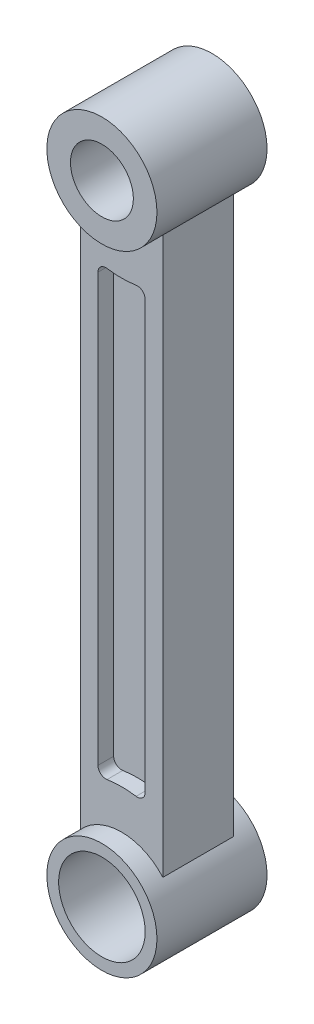
ISO-10303-21;
HEADER;
FILE_DESCRIPTION(('STEP AP214'),'2;1');
FILE_NAME('part.step','',(''),(''),'','','');
FILE_SCHEMA(('AUTOMOTIVE_DESIGN { 1 0 10303 214 1 1 1 1 }'));
ENDSEC;
DATA;
#1=APPLICATION_CONTEXT('core data for automotive mechanical design processes');
#2=APPLICATION_PROTOCOL_DEFINITION('international standard','automotive_design',2000,#1);
#3=PRODUCT_CONTEXT('',#1,'mechanical');
#4=PRODUCT('Part','Part','',(#3));
#5=PRODUCT_RELATED_PRODUCT_CATEGORY('part','',(#4));
#6=PRODUCT_DEFINITION_FORMATION('','',#4);
#7=PRODUCT_DEFINITION_CONTEXT('part definition',#1,'design');
#8=PRODUCT_DEFINITION('design','',#6,#7);
#9=PRODUCT_DEFINITION_SHAPE('','',#8);
#10=(LENGTH_UNIT() NAMED_UNIT(*) SI_UNIT(.MILLI.,.METRE.));
#11=(NAMED_UNIT(*) PLANE_ANGLE_UNIT() SI_UNIT($,.RADIAN.));
#12=(NAMED_UNIT(*) SI_UNIT($,.STERADIAN.) SOLID_ANGLE_UNIT());
#13=UNCERTAINTY_MEASURE_WITH_UNIT(LENGTH_MEASURE(1.E-05),#10,'distance_accuracy_value','');
#14=(GEOMETRIC_REPRESENTATION_CONTEXT(3) GLOBAL_UNCERTAINTY_ASSIGNED_CONTEXT((#13)) GLOBAL_UNIT_ASSIGNED_CONTEXT((#10,
#11,#12)) REPRESENTATION_CONTEXT('',''));
#15=CARTESIAN_POINT('',(0.,0.,0.));
#16=DIRECTION('',(0.,0.,1.));
#17=DIRECTION('',(1.,0.,0.));
#18=AXIS2_PLACEMENT_3D('',#15,#16,#17);
#19=CARTESIAN_POINT('',(0.,80.,-4.5));
#20=DIRECTION('',(0.,0.,1.));
#21=DIRECTION('',(1.,0.,0.));
#22=AXIS2_PLACEMENT_3D('',#19,#20,#21);
#23=PLANE('',#22);
#24=CARTESIAN_POINT('',(0.,80.,-4.5));
#25=DIRECTION('',(0.,0.,-1.));
#26=DIRECTION('',(1.,0.,0.));
#27=AXIS2_PLACEMENT_3D('',#24,#25,#26);
#28=CIRCLE('',#27,7.00000000000001);
#29=CARTESIAN_POINT('',(5.25,75.369935205637,-4.5));
#30=VERTEX_POINT('',#29);
#31=CARTESIAN_POINT('',(-5.25,75.369935205637,-4.5));
#32=VERTEX_POINT('',#31);
#33=EDGE_CURVE('E366',#30,#32,#28,.T.);
#34=ORIENTED_EDGE('',*,*,#33,.F.);
#35=DIRECTION('',(0.,1.,0.));
#36=VECTOR('',#35,1.);
#37=CARTESIAN_POINT('',(5.25,75.369935205637,-4.5));
#38=LINE('',#37,#36);
#39=CARTESIAN_POINT('',(5.25000000000001,4.63006479436302,-4.5));
#40=VERTEX_POINT('',#39);
#41=EDGE_CURVE('E375',#40,#30,#38,.T.);
#42=ORIENTED_EDGE('',*,*,#41,.F.);
#43=CARTESIAN_POINT('',(0.,0.,-4.5));
#44=DIRECTION('',(0.,0.,-1.));
#45=DIRECTION('',(-1.,0.,0.));
#46=AXIS2_PLACEMENT_3D('',#43,#44,#45);
#47=CIRCLE('',#46,7.);
#48=CARTESIAN_POINT('',(-5.24999999999999,4.63006479436304,-4.5));
#49=VERTEX_POINT('',#48);
#50=EDGE_CURVE('E394',#49,#40,#47,.T.);
#51=ORIENTED_EDGE('',*,*,#50,.F.);
#52=DIRECTION('',(0.,-1.,0.));
#53=VECTOR('',#52,1.);
#54=CARTESIAN_POINT('',(-5.25,75.369935205637,-4.5));
#55=LINE('',#54,#53);
#56=EDGE_CURVE('E390',#32,#49,#55,.T.);
#57=ORIENTED_EDGE('',*,*,#56,.F.);
#58=EDGE_LOOP('',(#34,#42,#51,#57));
#59=FACE_BOUND('',#58,.T.);
#60=CARTESIAN_POINT('',(0.,80.,-4.5));
#61=DIRECTION('',(0.,0.,1.));
#62=DIRECTION('',(1.,0.,0.));
#63=AXIS2_PLACEMENT_3D('',#60,#61,#62);
#64=CIRCLE('',#63,12.);
#65=CARTESIAN_POINT('',(-1.84615384615385,68.1428622350783,-4.5));
#66=VERTEX_POINT('',#65);
#67=CARTESIAN_POINT('',(1.84615384615385,68.1428622350783,-4.5));
#68=VERTEX_POINT('',#67);
#69=EDGE_CURVE('E228',#66,#68,#64,.T.);
#70=ORIENTED_EDGE('',*,*,#69,.F.);
#71=CARTESIAN_POINT('',(-2.,67.1547674213349,-4.5));
#72=DIRECTION('',(0.,0.,1.));
#73=DIRECTION('',(1.,0.,0.));
#74=AXIS2_PLACEMENT_3D('',#71,#72,#73);
#75=CIRCLE('',#74,1.);
#76=CARTESIAN_POINT('',(-3.,67.1547674213349,-4.5));
#77=VERTEX_POINT('',#76);
#78=EDGE_CURVE('E55',#77,#66,#75,.F.);
#79=ORIENTED_EDGE('',*,*,#78,.F.);
#80=DIRECTION('',(0.,-1.,0.));
#81=VECTOR('',#80,1.);
#82=CARTESIAN_POINT('',(-2.99999999999999,0.,-4.5));
#83=LINE('',#82,#81);
#84=CARTESIAN_POINT('',(-2.99999999999999,12.8452325786651,-4.5));
#85=VERTEX_POINT('',#84);
#86=EDGE_CURVE('E201',#77,#85,#83,.T.);
#87=ORIENTED_EDGE('',*,*,#86,.T.);
#88=CARTESIAN_POINT('',(-1.99999999999999,12.8452325786651,-4.5));
#89=DIRECTION('',(0.,0.,1.));
#90=DIRECTION('',(1.,0.,0.));
#91=AXIS2_PLACEMENT_3D('',#88,#89,#90);
#92=CIRCLE('',#91,1.);
#93=CARTESIAN_POINT('',(-1.84615384615384,11.8571377649217,-4.5));
#94=VERTEX_POINT('',#93);
#95=EDGE_CURVE('E205',#85,#94,#92,.T.);
#96=ORIENTED_EDGE('',*,*,#95,.T.);
#97=CARTESIAN_POINT('',(0.,0.,-4.5));
#98=DIRECTION('',(0.,0.,1.));
#99=DIRECTION('',(1.,0.,0.));
#100=AXIS2_PLACEMENT_3D('',#97,#98,#99);
#101=CIRCLE('',#100,12.);
#102=CARTESIAN_POINT('',(1.84615384615386,11.8571377649217,-4.5));
#103=VERTEX_POINT('',#102);
#104=EDGE_CURVE('E243',#94,#103,#101,.F.);
#105=ORIENTED_EDGE('',*,*,#104,.T.);
#106=CARTESIAN_POINT('',(2.00000000000002,12.8452325786651,-4.5));
#107=DIRECTION('',(0.,0.,1.));
#108=DIRECTION('',(1.,0.,0.));
#109=AXIS2_PLACEMENT_3D('',#106,#107,#108);
#110=CIRCLE('',#109,1.);
#111=CARTESIAN_POINT('',(3.00000000000002,12.8452325786651,-4.5));
#112=VERTEX_POINT('',#111);
#113=EDGE_CURVE('E239',#112,#103,#110,.F.);
#114=ORIENTED_EDGE('',*,*,#113,.F.);
#115=DIRECTION('',(0.,-1.,0.));
#116=VECTOR('',#115,1.);
#117=CARTESIAN_POINT('',(3.00000000000002,0.,-4.5));
#118=LINE('',#117,#116);
#119=CARTESIAN_POINT('',(3.00000000000001,67.1547674213349,-4.5));
#120=VERTEX_POINT('',#119);
#121=EDGE_CURVE('E235',#120,#112,#118,.T.);
#122=ORIENTED_EDGE('',*,*,#121,.F.);
#123=CARTESIAN_POINT('',(2.00000000000001,67.1547674213349,-4.5));
#124=DIRECTION('',(0.,0.,1.));
#125=DIRECTION('',(1.,0.,0.));
#126=AXIS2_PLACEMENT_3D('',#123,#124,#125);
#127=CIRCLE('',#126,1.);
#128=EDGE_CURVE('E231',#120,#68,#127,.T.);
#129=ORIENTED_EDGE('',*,*,#128,.T.);
#130=EDGE_LOOP('',(#70,#79,#87,#96,#105,#114,#122,#129));
#131=FACE_BOUND('',#130,.T.);
#132=ADVANCED_FACE('F39',(#59,#131),#23,.F.);
#133=CARTESIAN_POINT('',(0.,80.,4.5));
#134=DIRECTION('',(0.,0.,1.));
#135=DIRECTION('',(1.,0.,0.));
#136=AXIS2_PLACEMENT_3D('',#133,#134,#135);
#137=PLANE('',#136);
#138=CARTESIAN_POINT('',(0.,80.,4.5));
#139=DIRECTION('',(0.,0.,-1.));
#140=DIRECTION('',(1.,0.,0.));
#141=AXIS2_PLACEMENT_3D('',#138,#139,#140);
#142=CIRCLE('',#141,7.00000000000001);
#143=CARTESIAN_POINT('',(5.25,75.369935205637,4.5));
#144=VERTEX_POINT('',#143);
#145=CARTESIAN_POINT('',(-5.25,75.369935205637,4.5));
#146=VERTEX_POINT('',#145);
#147=EDGE_CURVE('E370',#144,#146,#142,.T.);
#148=ORIENTED_EDGE('',*,*,#147,.T.);
#149=DIRECTION('',(0.,-1.,0.));
#150=VECTOR('',#149,1.);
#151=CARTESIAN_POINT('',(-5.25,75.369935205637,4.5));
#152=LINE('',#151,#150);
#153=CARTESIAN_POINT('',(-5.24999999999999,4.63006479436304,4.5));
#154=VERTEX_POINT('',#153);
#155=EDGE_CURVE('E374',#146,#154,#152,.T.);
#156=ORIENTED_EDGE('',*,*,#155,.T.);
#157=CARTESIAN_POINT('',(0.,0.,4.5));
#158=DIRECTION('',(0.,0.,-1.));
#159=DIRECTION('',(-1.,0.,0.));
#160=AXIS2_PLACEMENT_3D('',#157,#158,#159);
#161=CIRCLE('',#160,7.);
#162=CARTESIAN_POINT('',(5.25000000000001,4.63006479436302,4.5));
#163=VERTEX_POINT('',#162);
#164=EDGE_CURVE('E379',#154,#163,#161,.T.);
#165=ORIENTED_EDGE('',*,*,#164,.T.);
#166=DIRECTION('',(0.,1.,0.));
#167=VECTOR('',#166,1.);
#168=CARTESIAN_POINT('',(5.25,75.369935205637,4.5));
#169=LINE('',#168,#167);
#170=EDGE_CURVE('E383',#163,#144,#169,.T.);
#171=ORIENTED_EDGE('',*,*,#170,.T.);
#172=EDGE_LOOP('',(#148,#156,#165,#171));
#173=FACE_BOUND('',#172,.T.);
#174=DIRECTION('',(0.,-1.,0.));
#175=VECTOR('',#174,1.);
#176=CARTESIAN_POINT('',(-2.99999999999999,0.,4.5));
#177=LINE('',#176,#175);
#178=CARTESIAN_POINT('',(-3.,67.1547674213349,4.5));
#179=VERTEX_POINT('',#178);
#180=CARTESIAN_POINT('',(-2.99999999999999,12.8452325786651,4.5));
#181=VERTEX_POINT('',#180);
#182=EDGE_CURVE('E303',#179,#181,#177,.T.);
#183=ORIENTED_EDGE('',*,*,#182,.F.);
#184=CARTESIAN_POINT('',(-2.,67.1547674213349,4.5));
#185=DIRECTION('',(0.,0.,1.));
#186=DIRECTION('',(1.,0.,0.));
#187=AXIS2_PLACEMENT_3D('',#184,#185,#186);
#188=CIRCLE('',#187,1.);
#189=CARTESIAN_POINT('',(-1.84615384615385,68.1428622350783,4.5));
#190=VERTEX_POINT('',#189);
#191=EDGE_CURVE('E63',#179,#190,#188,.F.);
#192=ORIENTED_EDGE('',*,*,#191,.T.);
#193=CARTESIAN_POINT('',(0.,80.,4.5));
#194=DIRECTION('',(0.,0.,1.));
#195=DIRECTION('',(1.,0.,0.));
#196=AXIS2_PLACEMENT_3D('',#193,#194,#195);
#197=CIRCLE('',#196,12.);
#198=CARTESIAN_POINT('',(1.84615384615385,68.1428622350783,4.5));
#199=VERTEX_POINT('',#198);
#200=EDGE_CURVE('E275',#190,#199,#197,.T.);
#201=ORIENTED_EDGE('',*,*,#200,.T.);
#202=CARTESIAN_POINT('',(2.00000000000001,67.1547674213349,4.5));
#203=DIRECTION('',(0.,0.,1.));
#204=DIRECTION('',(1.,0.,0.));
#205=AXIS2_PLACEMENT_3D('',#202,#203,#204);
#206=CIRCLE('',#205,1.);
#207=CARTESIAN_POINT('',(3.00000000000001,67.1547674213349,4.5));
#208=VERTEX_POINT('',#207);
#209=EDGE_CURVE('E323',#208,#199,#206,.T.);
#210=ORIENTED_EDGE('',*,*,#209,.F.);
#211=DIRECTION('',(0.,-1.,0.));
#212=VECTOR('',#211,1.);
#213=CARTESIAN_POINT('',(3.00000000000002,0.,4.5));
#214=LINE('',#213,#212);
#215=CARTESIAN_POINT('',(3.00000000000002,12.8452325786651,4.5));
#216=VERTEX_POINT('',#215);
#217=EDGE_CURVE('E319',#208,#216,#214,.T.);
#218=ORIENTED_EDGE('',*,*,#217,.T.);
#219=CARTESIAN_POINT('',(2.00000000000002,12.8452325786651,4.5));
#220=DIRECTION('',(0.,0.,1.));
#221=DIRECTION('',(1.,0.,0.));
#222=AXIS2_PLACEMENT_3D('',#219,#220,#221);
#223=CIRCLE('',#222,1.);
#224=CARTESIAN_POINT('',(1.84615384615386,11.8571377649217,4.5));
#225=VERTEX_POINT('',#224);
#226=EDGE_CURVE('E315',#216,#225,#223,.F.);
#227=ORIENTED_EDGE('',*,*,#226,.T.);
#228=CARTESIAN_POINT('',(0.,0.,4.5));
#229=DIRECTION('',(0.,0.,1.));
#230=DIRECTION('',(1.,0.,0.));
#231=AXIS2_PLACEMENT_3D('',#228,#229,#230);
#232=CIRCLE('',#231,12.);
#233=CARTESIAN_POINT('',(-1.84615384615384,11.8571377649217,4.5));
#234=VERTEX_POINT('',#233);
#235=EDGE_CURVE('E311',#234,#225,#232,.F.);
#236=ORIENTED_EDGE('',*,*,#235,.F.);
#237=CARTESIAN_POINT('',(-1.99999999999999,12.8452325786651,4.5));
#238=DIRECTION('',(0.,0.,1.));
#239=DIRECTION('',(1.,0.,0.));
#240=AXIS2_PLACEMENT_3D('',#237,#238,#239);
#241=CIRCLE('',#240,1.);
#242=EDGE_CURVE('E307',#181,#234,#241,.T.);
#243=ORIENTED_EDGE('',*,*,#242,.F.);
#244=EDGE_LOOP('',(#183,#192,#201,#210,#218,#227,#236,#243));
#245=FACE_BOUND('',#244,.T.);
#246=ADVANCED_FACE('F438',(#173,#245),#137,.T.);
#247=CARTESIAN_POINT('',(0.,0.,7.));
#248=DIRECTION('',(0.,0.,1.));
#249=DIRECTION('',(1.,0.,0.));
#250=AXIS2_PLACEMENT_3D('',#247,#248,#249);
#251=PLANE('',#250);
#252=CARTESIAN_POINT('',(0.,0.,7.));
#253=DIRECTION('',(0.,0.,1.));
#254=DIRECTION('',(1.,0.,0.));
#255=AXIS2_PLACEMENT_3D('',#252,#253,#254);
#256=CIRCLE('',#255,7.);
#257=CARTESIAN_POINT('',(7.,0.,7.));
#258=VERTEX_POINT('',#257);
#259=EDGE_CURVE('E11',#258,#258,#256,.T.);
#260=ORIENTED_EDGE('',*,*,#259,.T.);
#261=EDGE_LOOP('',(#260));
#262=FACE_BOUND('',#261,.T.);
#263=CARTESIAN_POINT('',(0.,0.,7.));
#264=DIRECTION('',(0.,0.,1.));
#265=DIRECTION('',(1.,0.,0.));
#266=AXIS2_PLACEMENT_3D('',#263,#264,#265);
#267=CIRCLE('',#266,5.5);
#268=CARTESIAN_POINT('',(5.5,0.,7.));
#269=VERTEX_POINT('',#268);
#270=EDGE_CURVE('E413',#269,#269,#267,.T.);
#271=ORIENTED_EDGE('',*,*,#270,.F.);
#272=EDGE_LOOP('',(#271));
#273=FACE_BOUND('',#272,.T.);
#274=ADVANCED_FACE('F444',(#262,#273),#251,.T.);
#275=CARTESIAN_POINT('',(0.,0.,-7.));
#276=DIRECTION('',(0.,0.,1.));
#277=DIRECTION('',(1.,0.,0.));
#278=AXIS2_PLACEMENT_3D('',#275,#276,#277);
#279=PLANE('',#278);
#280=CARTESIAN_POINT('',(0.,0.,-7.));
#281=DIRECTION('',(0.,0.,1.));
#282=DIRECTION('',(1.,0.,0.));
#283=AXIS2_PLACEMENT_3D('',#280,#281,#282);
#284=CIRCLE('',#283,7.);
#285=CARTESIAN_POINT('',(7.,0.,-7.));
#286=VERTEX_POINT('',#285);
#287=EDGE_CURVE('E43',#286,#286,#284,.T.);
#288=ORIENTED_EDGE('',*,*,#287,.F.);
#289=EDGE_LOOP('',(#288));
#290=FACE_BOUND('',#289,.T.);
#291=CARTESIAN_POINT('',(0.,0.,-7.));
#292=DIRECTION('',(0.,0.,1.));
#293=DIRECTION('',(1.,0.,0.));
#294=AXIS2_PLACEMENT_3D('',#291,#292,#293);
#295=CIRCLE('',#294,5.5);
#296=CARTESIAN_POINT('',(5.5,0.,-7.));
#297=VERTEX_POINT('',#296);
#298=EDGE_CURVE('E412',#297,#297,#295,.T.);
#299=ORIENTED_EDGE('',*,*,#298,.T.);
#300=EDGE_LOOP('',(#299));
#301=FACE_BOUND('',#300,.T.);
#302=ADVANCED_FACE('F421',(#290,#301),#279,.F.);
#303=CARTESIAN_POINT('',(0.,0.,7.));
#304=DIRECTION('',(0.,0.,-1.));
#305=DIRECTION('',(-1.,0.,0.));
#306=AXIS2_PLACEMENT_3D('',#303,#304,#305);
#307=CYLINDRICAL_SURFACE('',#306,7.);
#308=DIRECTION('',(0.,0.,-1.));
#309=VECTOR('',#308,1.);
#310=CARTESIAN_POINT('',(5.25000000000001,4.63006479436303,4.5));
#311=LINE('',#310,#309);
#312=EDGE_CURVE('E402',#163,#40,#311,.T.);
#313=ORIENTED_EDGE('',*,*,#312,.F.);
#314=ORIENTED_EDGE('',*,*,#164,.F.);
#315=DIRECTION('',(0.,0.,-1.));
#316=VECTOR('',#315,1.);
#317=CARTESIAN_POINT('',(-5.24999999999999,4.63006479436304,4.5));
#318=LINE('',#317,#316);
#319=EDGE_CURVE('E406',#154,#49,#318,.T.);
#320=ORIENTED_EDGE('',*,*,#319,.T.);
#321=ORIENTED_EDGE('',*,*,#50,.T.);
#322=EDGE_LOOP('',(#313,#314,#320,#321));
#323=FACE_BOUND('',#322,.T.);
#324=ORIENTED_EDGE('',*,*,#259,.F.);
#325=EDGE_LOOP('',(#324));
#326=FACE_BOUND('',#325,.T.);
#327=ORIENTED_EDGE('',*,*,#287,.T.);
#328=EDGE_LOOP('',(#327));
#329=FACE_BOUND('',#328,.T.);
#330=ADVANCED_FACE('F41',(#323,#326,#329),#307,.T.);
#331=CARTESIAN_POINT('',(0.,0.,7.));
#332=DIRECTION('',(0.,0.,-1.));
#333=DIRECTION('',(-1.,0.,0.));
#334=AXIS2_PLACEMENT_3D('',#331,#332,#333);
#335=CYLINDRICAL_SURFACE('',#334,5.5);
#336=ORIENTED_EDGE('',*,*,#270,.T.);
#337=EDGE_LOOP('',(#336));
#338=FACE_BOUND('',#337,.T.);
#339=ORIENTED_EDGE('',*,*,#298,.F.);
#340=EDGE_LOOP('',(#339));
#341=FACE_BOUND('',#340,.T.);
#342=ADVANCED_FACE('F423',(#338,#341),#335,.F.);
#343=CARTESIAN_POINT('',(-5.25,75.369935205637,4.5));
#344=DIRECTION('',(1.,0.,0.));
#345=DIRECTION('',(0.,1.,0.));
#346=AXIS2_PLACEMENT_3D('',#343,#344,#345);
#347=PLANE('',#346);
#348=ORIENTED_EDGE('',*,*,#56,.T.);
#349=ORIENTED_EDGE('',*,*,#319,.F.);
#350=ORIENTED_EDGE('',*,*,#155,.F.);
#351=DIRECTION('',(0.,0.,-1.));
#352=VECTOR('',#351,1.);
#353=CARTESIAN_POINT('',(-5.25,75.369935205637,4.5));
#354=LINE('',#353,#352);
#355=EDGE_CURVE('E409',#146,#32,#354,.T.);
#356=ORIENTED_EDGE('',*,*,#355,.T.);
#357=EDGE_LOOP('',(#348,#349,#350,#356));
#358=FACE_BOUND('',#357,.T.);
#359=ADVANCED_FACE('F425',(#358),#347,.F.);
#360=CARTESIAN_POINT('',(5.25,75.369935205637,4.5));
#361=DIRECTION('',(-1.,0.,0.));
#362=DIRECTION('',(0.,-1.,0.));
#363=AXIS2_PLACEMENT_3D('',#360,#361,#362);
#364=PLANE('',#363);
#365=ORIENTED_EDGE('',*,*,#41,.T.);
#366=DIRECTION('',(0.,0.,-1.));
#367=VECTOR('',#366,1.);
#368=CARTESIAN_POINT('',(5.25,75.369935205637,4.5));
#369=LINE('',#368,#367);
#370=EDGE_CURVE('E386',#144,#30,#369,.T.);
#371=ORIENTED_EDGE('',*,*,#370,.F.);
#372=ORIENTED_EDGE('',*,*,#170,.F.);
#373=ORIENTED_EDGE('',*,*,#312,.T.);
#374=EDGE_LOOP('',(#365,#371,#372,#373));
#375=FACE_BOUND('',#374,.T.);
#376=ADVANCED_FACE('F432',(#375),#364,.F.);
#377=CARTESIAN_POINT('',(0.,80.,7.));
#378=DIRECTION('',(0.,0.,1.));
#379=DIRECTION('',(1.,0.,0.));
#380=AXIS2_PLACEMENT_3D('',#377,#378,#379);
#381=PLANE('',#380);
#382=CARTESIAN_POINT('',(0.,80.,7.));
#383=DIRECTION('',(0.,0.,1.));
#384=DIRECTION('',(1.,0.,0.));
#385=AXIS2_PLACEMENT_3D('',#382,#383,#384);
#386=CIRCLE('',#385,7.);
#387=CARTESIAN_POINT('',(7.,80.,7.));
#388=VERTEX_POINT('',#387);
#389=EDGE_CURVE('E362',#388,#388,#386,.T.);
#390=ORIENTED_EDGE('',*,*,#389,.T.);
#391=EDGE_LOOP('',(#390));
#392=FACE_BOUND('',#391,.T.);
#393=CARTESIAN_POINT('',(0.,80.,7.));
#394=DIRECTION('',(0.,0.,1.));
#395=DIRECTION('',(1.,0.,0.));
#396=AXIS2_PLACEMENT_3D('',#393,#394,#395);
#397=CIRCLE('',#396,4.);
#398=CARTESIAN_POINT('',(4.,80.,7.));
#399=VERTEX_POINT('',#398);
#400=EDGE_CURVE('E354',#399,#399,#397,.T.);
#401=ORIENTED_EDGE('',*,*,#400,.F.);
#402=EDGE_LOOP('',(#401));
#403=FACE_BOUND('',#402,.T.);
#404=ADVANCED_FACE('F452',(#392,#403),#381,.T.);
#405=CARTESIAN_POINT('',(0.,80.,-7.));
#406=DIRECTION('',(0.,0.,1.));
#407=DIRECTION('',(1.,0.,0.));
#408=AXIS2_PLACEMENT_3D('',#405,#406,#407);
#409=PLANE('',#408);
#410=CARTESIAN_POINT('',(0.,80.,-7.));
#411=DIRECTION('',(0.,0.,1.));
#412=DIRECTION('',(1.,0.,0.));
#413=AXIS2_PLACEMENT_3D('',#410,#411,#412);
#414=CIRCLE('',#413,7.);
#415=CARTESIAN_POINT('',(7.,80.,-7.));
#416=VERTEX_POINT('',#415);
#417=EDGE_CURVE('E358',#416,#416,#414,.T.);
#418=ORIENTED_EDGE('',*,*,#417,.F.);
#419=EDGE_LOOP('',(#418));
#420=FACE_BOUND('',#419,.T.);
#421=CARTESIAN_POINT('',(0.,80.,-7.));
#422=DIRECTION('',(0.,0.,1.));
#423=DIRECTION('',(1.,0.,0.));
#424=AXIS2_PLACEMENT_3D('',#421,#422,#423);
#425=CIRCLE('',#424,4.);
#426=CARTESIAN_POINT('',(4.,80.,-7.));
#427=VERTEX_POINT('',#426);
#428=EDGE_CURVE('E333',#427,#427,#425,.T.);
#429=ORIENTED_EDGE('',*,*,#428,.T.);
#430=EDGE_LOOP('',(#429));
#431=FACE_BOUND('',#430,.T.);
#432=ADVANCED_FACE('F457',(#420,#431),#409,.F.);
#433=CARTESIAN_POINT('',(0.,80.,7.));
#434=DIRECTION('',(0.,0.,-1.));
#435=DIRECTION('',(-1.,0.,0.));
#436=AXIS2_PLACEMENT_3D('',#433,#434,#435);
#437=CYLINDRICAL_SURFACE('',#436,7.);
#438=ORIENTED_EDGE('',*,*,#147,.F.);
#439=ORIENTED_EDGE('',*,*,#370,.T.);
#440=ORIENTED_EDGE('',*,*,#33,.T.);
#441=ORIENTED_EDGE('',*,*,#355,.F.);
#442=EDGE_LOOP('',(#438,#439,#440,#441));
#443=FACE_BOUND('',#442,.T.);
#444=ORIENTED_EDGE('',*,*,#389,.F.);
#445=EDGE_LOOP('',(#444));
#446=FACE_BOUND('',#445,.T.);
#447=ORIENTED_EDGE('',*,*,#417,.T.);
#448=EDGE_LOOP('',(#447));
#449=FACE_BOUND('',#448,.T.);
#450=ADVANCED_FACE('F468',(#443,#446,#449),#437,.T.);
#451=CARTESIAN_POINT('',(0.,80.,7.));
#452=DIRECTION('',(0.,0.,-1.));
#453=DIRECTION('',(-1.,0.,0.));
#454=AXIS2_PLACEMENT_3D('',#451,#452,#453);
#455=CYLINDRICAL_SURFACE('',#454,4.);
#456=ORIENTED_EDGE('',*,*,#400,.T.);
#457=EDGE_LOOP('',(#456));
#458=FACE_BOUND('',#457,.T.);
#459=ORIENTED_EDGE('',*,*,#428,.F.);
#460=EDGE_LOOP('',(#459));
#461=FACE_BOUND('',#460,.T.);
#462=ADVANCED_FACE('F500',(#458,#461),#455,.F.);
#463=CARTESIAN_POINT('',(-2.,67.1547674213349,2.5));
#464=DIRECTION('',(0.,0.,1.));
#465=DIRECTION('',(1.,0.,0.));
#466=AXIS2_PLACEMENT_3D('',#463,#464,#465);
#467=CYLINDRICAL_SURFACE('',#466,1.);
#468=ORIENTED_EDGE('',*,*,#191,.F.);
#469=DIRECTION('',(0.,0.,1.));
#470=VECTOR('',#469,1.);
#471=CARTESIAN_POINT('',(-3.,67.1547674213349,2.5));
#472=LINE('',#471,#470);
#473=CARTESIAN_POINT('',(-3.,67.1547674213349,2.5));
#474=VERTEX_POINT('',#473);
#475=EDGE_CURVE('E300',#474,#179,#472,.T.);
#476=ORIENTED_EDGE('',*,*,#475,.F.);
#477=CARTESIAN_POINT('',(-2.,67.1547674213349,2.5));
#478=DIRECTION('',(0.,0.,1.));
#479=DIRECTION('',(1.,0.,0.));
#480=AXIS2_PLACEMENT_3D('',#477,#478,#479);
#481=CIRCLE('',#480,1.);
#482=CARTESIAN_POINT('',(-1.84615384615385,68.1428622350783,2.5));
#483=VERTEX_POINT('',#482);
#484=EDGE_CURVE('E270',#474,#483,#481,.F.);
#485=ORIENTED_EDGE('',*,*,#484,.T.);
#486=DIRECTION('',(0.,0.,1.));
#487=VECTOR('',#486,1.);
#488=CARTESIAN_POINT('',(-1.84615384615385,68.1428622350783,2.5));
#489=LINE('',#488,#487);
#490=EDGE_CURVE('E330',#483,#190,#489,.T.);
#491=ORIENTED_EDGE('',*,*,#490,.T.);
#492=EDGE_LOOP('',(#468,#476,#485,#491));
#493=FACE_BOUND('',#492,.T.);
#494=ADVANCED_FACE('F505',(#493),#467,.F.);
#495=CARTESIAN_POINT('',(0.,80.,2.5));
#496=DIRECTION('',(0.,0.,1.));
#497=DIRECTION('',(1.,0.,0.));
#498=AXIS2_PLACEMENT_3D('',#495,#496,#497);
#499=CYLINDRICAL_SURFACE('',#498,12.);
#500=ORIENTED_EDGE('',*,*,#200,.F.);
#501=ORIENTED_EDGE('',*,*,#490,.F.);
#502=CARTESIAN_POINT('',(0.,80.,2.5));
#503=DIRECTION('',(0.,0.,1.));
#504=DIRECTION('',(1.,0.,0.));
#505=AXIS2_PLACEMENT_3D('',#502,#503,#504);
#506=CIRCLE('',#505,12.);
#507=CARTESIAN_POINT('',(1.84615384615385,68.1428622350783,2.5));
#508=VERTEX_POINT('',#507);
#509=EDGE_CURVE('E297',#483,#508,#506,.T.);
#510=ORIENTED_EDGE('',*,*,#509,.T.);
#511=DIRECTION('',(0.,0.,1.));
#512=VECTOR('',#511,1.);
#513=CARTESIAN_POINT('',(1.84615384615385,68.1428622350783,2.5));
#514=LINE('',#513,#512);
#515=EDGE_CURVE('E334',#508,#199,#514,.T.);
#516=ORIENTED_EDGE('',*,*,#515,.T.);
#517=EDGE_LOOP('',(#500,#501,#510,#516));
#518=FACE_BOUND('',#517,.T.);
#519=ADVANCED_FACE('F509',(#518),#499,.T.);
#520=CARTESIAN_POINT('',(2.00000000000001,67.1547674213349,2.5));
#521=DIRECTION('',(0.,0.,1.));
#522=DIRECTION('',(1.,0.,0.));
#523=AXIS2_PLACEMENT_3D('',#520,#521,#522);
#524=CYLINDRICAL_SURFACE('',#523,1.);
#525=ORIENTED_EDGE('',*,*,#209,.T.);
#526=ORIENTED_EDGE('',*,*,#515,.F.);
#527=CARTESIAN_POINT('',(2.00000000000001,67.1547674213349,2.5));
#528=DIRECTION('',(0.,0.,1.));
#529=DIRECTION('',(1.,0.,0.));
#530=AXIS2_PLACEMENT_3D('',#527,#528,#529);
#531=CIRCLE('',#530,1.);
#532=CARTESIAN_POINT('',(3.00000000000001,67.1547674213349,2.5));
#533=VERTEX_POINT('',#532);
#534=EDGE_CURVE('E293',#533,#508,#531,.T.);
#535=ORIENTED_EDGE('',*,*,#534,.F.);
#536=DIRECTION('',(0.,0.,1.));
#537=VECTOR('',#536,1.);
#538=CARTESIAN_POINT('',(3.00000000000001,67.1547674213349,2.5));
#539=LINE('',#538,#537);
#540=EDGE_CURVE('E337',#533,#208,#539,.T.);
#541=ORIENTED_EDGE('',*,*,#540,.T.);
#542=EDGE_LOOP('',(#525,#526,#535,#541));
#543=FACE_BOUND('',#542,.T.);
#544=ADVANCED_FACE('F518',(#543),#524,.F.);
#545=CARTESIAN_POINT('',(3.00000000000002,0.,2.5));
#546=DIRECTION('',(-1.,0.,0.));
#547=DIRECTION('',(0.,-1.,0.));
#548=AXIS2_PLACEMENT_3D('',#545,#546,#547);
#549=PLANE('',#548);
#550=ORIENTED_EDGE('',*,*,#217,.F.);
#551=ORIENTED_EDGE('',*,*,#540,.F.);
#552=DIRECTION('',(0.,-1.,0.));
#553=VECTOR('',#552,1.);
#554=CARTESIAN_POINT('',(3.00000000000002,0.,2.5));
#555=LINE('',#554,#553);
#556=CARTESIAN_POINT('',(3.00000000000002,12.8452325786651,2.5));
#557=VERTEX_POINT('',#556);
#558=EDGE_CURVE('E290',#533,#557,#555,.T.);
#559=ORIENTED_EDGE('',*,*,#558,.T.);
#560=DIRECTION('',(0.,0.,1.));
#561=VECTOR('',#560,1.);
#562=CARTESIAN_POINT('',(3.00000000000002,12.8452325786651,2.5));
#563=LINE('',#562,#561);
#564=EDGE_CURVE('E340',#557,#216,#563,.T.);
#565=ORIENTED_EDGE('',*,*,#564,.T.);
#566=EDGE_LOOP('',(#550,#551,#559,#565));
#567=FACE_BOUND('',#566,.T.);
#568=ADVANCED_FACE('F528',(#567),#549,.T.);
#569=CARTESIAN_POINT('',(2.00000000000002,12.8452325786651,2.5));
#570=DIRECTION('',(0.,0.,1.));
#571=DIRECTION('',(1.,0.,0.));
#572=AXIS2_PLACEMENT_3D('',#569,#570,#571);
#573=CYLINDRICAL_SURFACE('',#572,1.);
#574=ORIENTED_EDGE('',*,*,#226,.F.);
#575=ORIENTED_EDGE('',*,*,#564,.F.);
#576=CARTESIAN_POINT('',(2.00000000000002,12.8452325786651,2.5));
#577=DIRECTION('',(0.,0.,1.));
#578=DIRECTION('',(1.,0.,0.));
#579=AXIS2_PLACEMENT_3D('',#576,#577,#578);
#580=CIRCLE('',#579,1.);
#581=CARTESIAN_POINT('',(1.84615384615386,11.8571377649217,2.5));
#582=VERTEX_POINT('',#581);
#583=EDGE_CURVE('E287',#557,#582,#580,.F.);
#584=ORIENTED_EDGE('',*,*,#583,.T.);
#585=DIRECTION('',(0.,0.,1.));
#586=VECTOR('',#585,1.);
#587=CARTESIAN_POINT('',(1.84615384615386,11.8571377649217,2.5));
#588=LINE('',#587,#586);
#589=EDGE_CURVE('E343',#582,#225,#588,.T.);
#590=ORIENTED_EDGE('',*,*,#589,.T.);
#591=EDGE_LOOP('',(#574,#575,#584,#590));
#592=FACE_BOUND('',#591,.T.);
#593=ADVANCED_FACE('F538',(#592),#573,.F.);
#594=CARTESIAN_POINT('',(0.,0.,2.5));
#595=DIRECTION('',(0.,0.,1.));
#596=DIRECTION('',(1.,0.,0.));
#597=AXIS2_PLACEMENT_3D('',#594,#595,#596);
#598=CYLINDRICAL_SURFACE('',#597,12.);
#599=ORIENTED_EDGE('',*,*,#235,.T.);
#600=ORIENTED_EDGE('',*,*,#589,.F.);
#601=CARTESIAN_POINT('',(0.,0.,2.5));
#602=DIRECTION('',(0.,0.,1.));
#603=DIRECTION('',(1.,0.,0.));
#604=AXIS2_PLACEMENT_3D('',#601,#602,#603);
#605=CIRCLE('',#604,12.);
#606=CARTESIAN_POINT('',(-1.84615384615384,11.8571377649217,2.5));
#607=VERTEX_POINT('',#606);
#608=EDGE_CURVE('E283',#607,#582,#605,.F.);
#609=ORIENTED_EDGE('',*,*,#608,.F.);
#610=DIRECTION('',(0.,0.,1.));
#611=VECTOR('',#610,1.);
#612=CARTESIAN_POINT('',(-1.84615384615384,11.8571377649217,2.5));
#613=LINE('',#612,#611);
#614=EDGE_CURVE('E346',#607,#234,#613,.T.);
#615=ORIENTED_EDGE('',*,*,#614,.T.);
#616=EDGE_LOOP('',(#599,#600,#609,#615));
#617=FACE_BOUND('',#616,.T.);
#618=ADVANCED_FACE('F548',(#617),#598,.T.);
#619=CARTESIAN_POINT('',(-1.99999999999999,12.8452325786651,2.5));
#620=DIRECTION('',(0.,0.,1.));
#621=DIRECTION('',(1.,0.,0.));
#622=AXIS2_PLACEMENT_3D('',#619,#620,#621);
#623=CYLINDRICAL_SURFACE('',#622,1.);
#624=ORIENTED_EDGE('',*,*,#242,.T.);
#625=ORIENTED_EDGE('',*,*,#614,.F.);
#626=CARTESIAN_POINT('',(-1.99999999999999,12.8452325786651,2.5));
#627=DIRECTION('',(0.,0.,1.));
#628=DIRECTION('',(1.,0.,0.));
#629=AXIS2_PLACEMENT_3D('',#626,#627,#628);
#630=CIRCLE('',#629,1.);
#631=CARTESIAN_POINT('',(-2.99999999999999,12.8452325786651,2.5));
#632=VERTEX_POINT('',#631);
#633=EDGE_CURVE('E279',#632,#607,#630,.T.);
#634=ORIENTED_EDGE('',*,*,#633,.F.);
#635=DIRECTION('',(0.,0.,1.));
#636=VECTOR('',#635,1.);
#637=CARTESIAN_POINT('',(-2.99999999999999,12.8452325786651,2.5));
#638=LINE('',#637,#636);
#639=EDGE_CURVE('E349',#632,#181,#638,.T.);
#640=ORIENTED_EDGE('',*,*,#639,.T.);
#641=EDGE_LOOP('',(#624,#625,#634,#640));
#642=FACE_BOUND('',#641,.T.);
#643=ADVANCED_FACE('F558',(#642),#623,.F.);
#644=CARTESIAN_POINT('',(-2.99999999999999,0.,2.5));
#645=DIRECTION('',(-1.,0.,0.));
#646=DIRECTION('',(0.,-1.,0.));
#647=AXIS2_PLACEMENT_3D('',#644,#645,#646);
#648=PLANE('',#647);
#649=ORIENTED_EDGE('',*,*,#182,.T.);
#650=ORIENTED_EDGE('',*,*,#639,.F.);
#651=DIRECTION('',(0.,-1.,0.));
#652=VECTOR('',#651,1.);
#653=CARTESIAN_POINT('',(-2.99999999999999,0.,2.5));
#654=LINE('',#653,#652);
#655=EDGE_CURVE('E274',#474,#632,#654,.T.);
#656=ORIENTED_EDGE('',*,*,#655,.F.);
#657=ORIENTED_EDGE('',*,*,#475,.T.);
#658=EDGE_LOOP('',(#649,#650,#656,#657));
#659=FACE_BOUND('',#658,.T.);
#660=ADVANCED_FACE('F568',(#659),#648,.F.);
#661=CARTESIAN_POINT('',(0.,0.,2.5));
#662=DIRECTION('',(0.,0.,1.));
#663=DIRECTION('',(1.,0.,0.));
#664=AXIS2_PLACEMENT_3D('',#661,#662,#663);
#665=PLANE('',#664);
#666=ORIENTED_EDGE('',*,*,#484,.F.);
#667=ORIENTED_EDGE('',*,*,#655,.T.);
#668=ORIENTED_EDGE('',*,*,#633,.T.);
#669=ORIENTED_EDGE('',*,*,#608,.T.);
#670=ORIENTED_EDGE('',*,*,#583,.F.);
#671=ORIENTED_EDGE('',*,*,#558,.F.);
#672=ORIENTED_EDGE('',*,*,#534,.T.);
#673=ORIENTED_EDGE('',*,*,#509,.F.);
#674=EDGE_LOOP('',(#666,#667,#668,#669,#670,#671,#672,#673));
#675=FACE_BOUND('',#674,.T.);
#676=ADVANCED_FACE('F578',(#675),#665,.T.);
#677=CARTESIAN_POINT('',(-2.,67.1547674213349,-2.5));
#678=DIRECTION('',(0.,0.,-1.));
#679=DIRECTION('',(-1.,0.,0.));
#680=AXIS2_PLACEMENT_3D('',#677,#678,#679);
#681=CYLINDRICAL_SURFACE('',#680,1.);
#682=ORIENTED_EDGE('',*,*,#78,.T.);
#683=DIRECTION('',(0.,0.,-1.));
#684=VECTOR('',#683,1.);
#685=CARTESIAN_POINT('',(-1.84615384615385,68.1428622350783,-2.5));
#686=LINE('',#685,#684);
#687=CARTESIAN_POINT('',(-1.84615384615385,68.1428622350783,-2.5));
#688=VERTEX_POINT('',#687);
#689=EDGE_CURVE('E176',#688,#66,#686,.T.);
#690=ORIENTED_EDGE('',*,*,#689,.F.);
#691=CARTESIAN_POINT('',(-2.,67.1547674213349,-2.5));
#692=DIRECTION('',(0.,0.,1.));
#693=DIRECTION('',(1.,0.,0.));
#694=AXIS2_PLACEMENT_3D('',#691,#692,#693);
#695=CIRCLE('',#694,1.);
#696=CARTESIAN_POINT('',(-3.,67.1547674213349,-2.5));
#697=VERTEX_POINT('',#696);
#698=EDGE_CURVE('E180',#697,#688,#695,.F.);
#699=ORIENTED_EDGE('',*,*,#698,.F.);
#700=DIRECTION('',(0.,0.,-1.));
#701=VECTOR('',#700,1.);
#702=CARTESIAN_POINT('',(-3.,67.1547674213349,-2.5));
#703=LINE('',#702,#701);
#704=EDGE_CURVE('E250',#697,#77,#703,.T.);
#705=ORIENTED_EDGE('',*,*,#704,.T.);
#706=EDGE_LOOP('',(#682,#690,#699,#705));
#707=FACE_BOUND('',#706,.T.);
#708=ADVANCED_FACE('F178',(#707),#681,.F.);
#709=CARTESIAN_POINT('',(-2.99999999999999,0.,-2.5));
#710=DIRECTION('',(1.,0.,0.));
#711=DIRECTION('',(0.,1.,0.));
#712=AXIS2_PLACEMENT_3D('',#709,#710,#711);
#713=PLANE('',#712);
#714=ORIENTED_EDGE('',*,*,#86,.F.);
#715=ORIENTED_EDGE('',*,*,#704,.F.);
#716=DIRECTION('',(0.,-1.,0.));
#717=VECTOR('',#716,1.);
#718=CARTESIAN_POINT('',(-2.99999999999999,0.,-2.5));
#719=LINE('',#718,#717);
#720=CARTESIAN_POINT('',(-2.99999999999999,12.8452325786651,-2.5));
#721=VERTEX_POINT('',#720);
#722=EDGE_CURVE('E186',#697,#721,#719,.T.);
#723=ORIENTED_EDGE('',*,*,#722,.T.);
#724=DIRECTION('',(0.,0.,-1.));
#725=VECTOR('',#724,1.);
#726=CARTESIAN_POINT('',(-2.99999999999999,12.8452325786651,-2.5));
#727=LINE('',#726,#725);
#728=EDGE_CURVE('E253',#721,#85,#727,.T.);
#729=ORIENTED_EDGE('',*,*,#728,.T.);
#730=EDGE_LOOP('',(#714,#715,#723,#729));
#731=FACE_BOUND('',#730,.T.);
#732=ADVANCED_FACE('F601',(#731),#713,.T.);
#733=CARTESIAN_POINT('',(-1.99999999999999,12.8452325786651,-2.5));
#734=DIRECTION('',(0.,0.,-1.));
#735=DIRECTION('',(-1.,0.,0.));
#736=AXIS2_PLACEMENT_3D('',#733,#734,#735);
#737=CYLINDRICAL_SURFACE('',#736,1.);
#738=ORIENTED_EDGE('',*,*,#95,.F.);
#739=ORIENTED_EDGE('',*,*,#728,.F.);
#740=CARTESIAN_POINT('',(-1.99999999999999,12.8452325786651,-2.5));
#741=DIRECTION('',(0.,0.,1.));
#742=DIRECTION('',(1.,0.,0.));
#743=AXIS2_PLACEMENT_3D('',#740,#741,#742);
#744=CIRCLE('',#743,1.);
#745=CARTESIAN_POINT('',(-1.84615384615384,11.8571377649217,-2.5));
#746=VERTEX_POINT('',#745);
#747=EDGE_CURVE('E221',#721,#746,#744,.T.);
#748=ORIENTED_EDGE('',*,*,#747,.T.);
#749=DIRECTION('',(0.,0.,-1.));
#750=VECTOR('',#749,1.);
#751=CARTESIAN_POINT('',(-1.84615384615384,11.8571377649217,-2.5));
#752=LINE('',#751,#750);
#753=EDGE_CURVE('E256',#746,#94,#752,.T.);
#754=ORIENTED_EDGE('',*,*,#753,.T.);
#755=EDGE_LOOP('',(#738,#739,#748,#754));
#756=FACE_BOUND('',#755,.T.);
#757=ADVANCED_FACE('F610',(#756),#737,.F.);
#758=CARTESIAN_POINT('',(0.,0.,-2.5));
#759=DIRECTION('',(0.,0.,-1.));
#760=DIRECTION('',(-1.,0.,0.));
#761=AXIS2_PLACEMENT_3D('',#758,#759,#760);
#762=CYLINDRICAL_SURFACE('',#761,12.);
#763=ORIENTED_EDGE('',*,*,#104,.F.);
#764=ORIENTED_EDGE('',*,*,#753,.F.);
#765=CARTESIAN_POINT('',(0.,0.,-2.5));
#766=DIRECTION('',(0.,0.,1.));
#767=DIRECTION('',(1.,0.,0.));
#768=AXIS2_PLACEMENT_3D('',#765,#766,#767);
#769=CIRCLE('',#768,12.);
#770=CARTESIAN_POINT('',(1.84615384615386,11.8571377649217,-2.5));
#771=VERTEX_POINT('',#770);
#772=EDGE_CURVE('E218',#746,#771,#769,.F.);
#773=ORIENTED_EDGE('',*,*,#772,.T.);
#774=DIRECTION('',(0.,0.,-1.));
#775=VECTOR('',#774,1.);
#776=CARTESIAN_POINT('',(1.84615384615386,11.8571377649217,-2.5));
#777=LINE('',#776,#775);
#778=EDGE_CURVE('E259',#771,#103,#777,.T.);
#779=ORIENTED_EDGE('',*,*,#778,.T.);
#780=EDGE_LOOP('',(#763,#764,#773,#779));
#781=FACE_BOUND('',#780,.T.);
#782=ADVANCED_FACE('F620',(#781),#762,.T.);
#783=CARTESIAN_POINT('',(2.00000000000002,12.8452325786651,-2.5));
#784=DIRECTION('',(0.,0.,-1.));
#785=DIRECTION('',(-1.,0.,0.));
#786=AXIS2_PLACEMENT_3D('',#783,#784,#785);
#787=CYLINDRICAL_SURFACE('',#786,1.);
#788=ORIENTED_EDGE('',*,*,#113,.T.);
#789=ORIENTED_EDGE('',*,*,#778,.F.);
#790=CARTESIAN_POINT('',(2.00000000000002,12.8452325786651,-2.5));
#791=DIRECTION('',(0.,0.,1.));
#792=DIRECTION('',(1.,0.,0.));
#793=AXIS2_PLACEMENT_3D('',#790,#791,#792);
#794=CIRCLE('',#793,1.);
#795=CARTESIAN_POINT('',(3.00000000000002,12.8452325786651,-2.5));
#796=VERTEX_POINT('',#795);
#797=EDGE_CURVE('E214',#796,#771,#794,.F.);
#798=ORIENTED_EDGE('',*,*,#797,.F.);
#799=DIRECTION('',(0.,0.,-1.));
#800=VECTOR('',#799,1.);
#801=CARTESIAN_POINT('',(3.00000000000002,12.8452325786651,-2.5));
#802=LINE('',#801,#800);
#803=EDGE_CURVE('E262',#796,#112,#802,.T.);
#804=ORIENTED_EDGE('',*,*,#803,.T.);
#805=EDGE_LOOP('',(#788,#789,#798,#804));
#806=FACE_BOUND('',#805,.T.);
#807=ADVANCED_FACE('F630',(#806),#787,.F.);
#808=CARTESIAN_POINT('',(3.00000000000002,0.,-2.5));
#809=DIRECTION('',(1.,0.,0.));
#810=DIRECTION('',(0.,1.,0.));
#811=AXIS2_PLACEMENT_3D('',#808,#809,#810);
#812=PLANE('',#811);
#813=ORIENTED_EDGE('',*,*,#121,.T.);
#814=ORIENTED_EDGE('',*,*,#803,.F.);
#815=DIRECTION('',(0.,-1.,0.));
#816=VECTOR('',#815,1.);
#817=CARTESIAN_POINT('',(3.00000000000002,0.,-2.5));
#818=LINE('',#817,#816);
#819=CARTESIAN_POINT('',(3.00000000000001,67.1547674213349,-2.5));
#820=VERTEX_POINT('',#819);
#821=EDGE_CURVE('E210',#820,#796,#818,.T.);
#822=ORIENTED_EDGE('',*,*,#821,.F.);
#823=DIRECTION('',(0.,0.,-1.));
#824=VECTOR('',#823,1.);
#825=CARTESIAN_POINT('',(3.00000000000001,67.1547674213349,-2.5));
#826=LINE('',#825,#824);
#827=EDGE_CURVE('E265',#820,#120,#826,.T.);
#828=ORIENTED_EDGE('',*,*,#827,.T.);
#829=EDGE_LOOP('',(#813,#814,#822,#828));
#830=FACE_BOUND('',#829,.T.);
#831=ADVANCED_FACE('F640',(#830),#812,.F.);
#832=CARTESIAN_POINT('',(2.00000000000001,67.1547674213349,-2.5));
#833=DIRECTION('',(0.,0.,-1.));
#834=DIRECTION('',(-1.,0.,0.));
#835=AXIS2_PLACEMENT_3D('',#832,#833,#834);
#836=CYLINDRICAL_SURFACE('',#835,1.);
#837=ORIENTED_EDGE('',*,*,#128,.F.);
#838=ORIENTED_EDGE('',*,*,#827,.F.);
#839=CARTESIAN_POINT('',(2.00000000000001,67.1547674213349,-2.5));
#840=DIRECTION('',(0.,0.,1.));
#841=DIRECTION('',(1.,0.,0.));
#842=AXIS2_PLACEMENT_3D('',#839,#840,#841);
#843=CIRCLE('',#842,1.);
#844=CARTESIAN_POINT('',(1.84615384615385,68.1428622350783,-2.5));
#845=VERTEX_POINT('',#844);
#846=EDGE_CURVE('E195',#820,#845,#843,.T.);
#847=ORIENTED_EDGE('',*,*,#846,.T.);
#848=DIRECTION('',(0.,0.,-1.));
#849=VECTOR('',#848,1.);
#850=CARTESIAN_POINT('',(1.84615384615385,68.1428622350783,-2.5));
#851=LINE('',#850,#849);
#852=EDGE_CURVE('E185',#845,#68,#851,.T.);
#853=ORIENTED_EDGE('',*,*,#852,.T.);
#854=EDGE_LOOP('',(#837,#838,#847,#853));
#855=FACE_BOUND('',#854,.T.);
#856=ADVANCED_FACE('F650',(#855),#836,.F.);
#857=CARTESIAN_POINT('',(0.,80.,-2.5));
#858=DIRECTION('',(0.,0.,-1.));
#859=DIRECTION('',(-1.,0.,0.));
#860=AXIS2_PLACEMENT_3D('',#857,#858,#859);
#861=CYLINDRICAL_SURFACE('',#860,12.);
#862=ORIENTED_EDGE('',*,*,#69,.T.);
#863=ORIENTED_EDGE('',*,*,#852,.F.);
#864=CARTESIAN_POINT('',(0.,80.,-2.5));
#865=DIRECTION('',(0.,0.,1.));
#866=DIRECTION('',(1.,0.,0.));
#867=AXIS2_PLACEMENT_3D('',#864,#865,#866);
#868=CIRCLE('',#867,12.);
#869=EDGE_CURVE('E190',#688,#845,#868,.T.);
#870=ORIENTED_EDGE('',*,*,#869,.F.);
#871=ORIENTED_EDGE('',*,*,#689,.T.);
#872=EDGE_LOOP('',(#862,#863,#870,#871));
#873=FACE_BOUND('',#872,.T.);
#874=ADVANCED_FACE('F191',(#873),#861,.T.);
#875=CARTESIAN_POINT('',(0.,0.,-2.5));
#876=DIRECTION('',(0.,0.,-1.));
#877=DIRECTION('',(1.,0.,0.));
#878=AXIS2_PLACEMENT_3D('',#875,#876,#877);
#879=PLANE('',#878);
#880=ORIENTED_EDGE('',*,*,#698,.T.);
#881=ORIENTED_EDGE('',*,*,#869,.T.);
#882=ORIENTED_EDGE('',*,*,#846,.F.);
#883=ORIENTED_EDGE('',*,*,#821,.T.);
#884=ORIENTED_EDGE('',*,*,#797,.T.);
#885=ORIENTED_EDGE('',*,*,#772,.F.);
#886=ORIENTED_EDGE('',*,*,#747,.F.);
#887=ORIENTED_EDGE('',*,*,#722,.F.);
#888=EDGE_LOOP('',(#880,#881,#882,#883,#884,#885,#886,#887));
#889=FACE_BOUND('',#888,.T.);
#890=ADVANCED_FACE('F198',(#889),#879,.T.);
#891=CLOSED_SHELL('',(#132,#246,#274,#302,#330,#342,#359,#376,#404,#432,#450,#462,#494,#519,
#544,#568,#593,#618,#643,#660,#676,#708,#732,#757,#782,#807,#831,#856,#874,#890));
#892=MANIFOLD_SOLID_BREP('B2',#891);
#893=ADVANCED_BREP_SHAPE_REPRESENTATION('',(#18,#892),#14);
#894=SHAPE_DEFINITION_REPRESENTATION(#9,#893);
ENDSEC;
END-ISO-10303-21;
